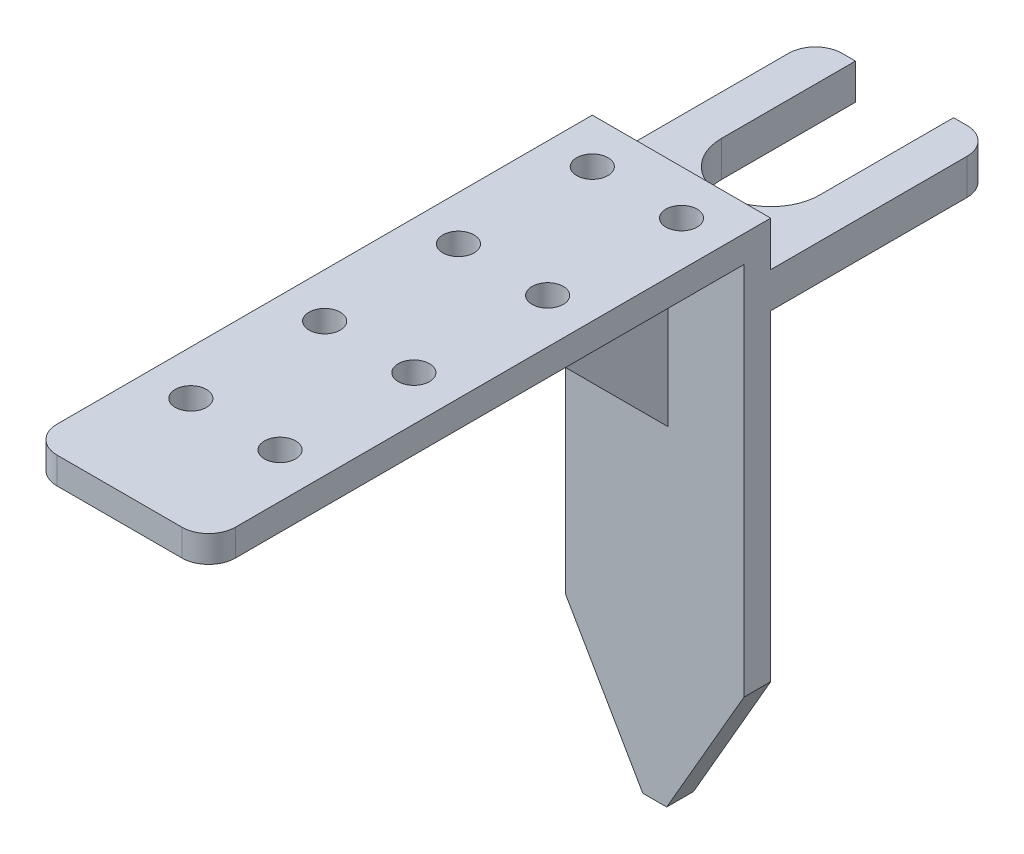
ISO-10303-21;
HEADER;
FILE_DESCRIPTION(('STEP AP214'),'2;1');
FILE_NAME('part.step','',(''),(''),'','','');
FILE_SCHEMA(('AUTOMOTIVE_DESIGN { 1 0 10303 214 1 1 1 1 }'));
ENDSEC;
DATA;
#1=APPLICATION_CONTEXT('core data for automotive mechanical design processes');
#2=APPLICATION_PROTOCOL_DEFINITION('international standard','automotive_design',2000,#1);
#3=PRODUCT_CONTEXT('',#1,'mechanical');
#4=PRODUCT('Part','Part','',(#3));
#5=PRODUCT_RELATED_PRODUCT_CATEGORY('part','',(#4));
#6=PRODUCT_DEFINITION_FORMATION('','',#4);
#7=PRODUCT_DEFINITION_CONTEXT('part definition',#1,'design');
#8=PRODUCT_DEFINITION('design','',#6,#7);
#9=PRODUCT_DEFINITION_SHAPE('','',#8);
#10=(LENGTH_UNIT() NAMED_UNIT(*) SI_UNIT(.MILLI.,.METRE.));
#11=(NAMED_UNIT(*) PLANE_ANGLE_UNIT() SI_UNIT($,.RADIAN.));
#12=(NAMED_UNIT(*) SI_UNIT($,.STERADIAN.) SOLID_ANGLE_UNIT());
#13=UNCERTAINTY_MEASURE_WITH_UNIT(LENGTH_MEASURE(1.E-05),#10,'distance_accuracy_value','');
#14=(GEOMETRIC_REPRESENTATION_CONTEXT(3) GLOBAL_UNCERTAINTY_ASSIGNED_CONTEXT((#13)) GLOBAL_UNIT_ASSIGNED_CONTEXT((#10,
#11,#12)) REPRESENTATION_CONTEXT('',''));
#15=CARTESIAN_POINT('',(0.,0.,0.));
#16=DIRECTION('',(0.,0.,1.));
#17=DIRECTION('',(1.,0.,0.));
#18=AXIS2_PLACEMENT_3D('',#15,#16,#17);
#19=CARTESIAN_POINT('',(0.,0.,-25.));
#20=DIRECTION('',(0.,0.,-1.));
#21=DIRECTION('',(-1.,0.,0.));
#22=AXIS2_PLACEMENT_3D('',#19,#20,#21);
#23=PLANE('',#22);
#24=DIRECTION('',(-1.,0.,0.));
#25=VECTOR('',#24,1.);
#26=CARTESIAN_POINT('',(10.,21.,-25.));
#27=LINE('',#26,#25);
#28=CARTESIAN_POINT('',(-5.5,21.,-25.));
#29=VERTEX_POINT('',#28);
#30=CARTESIAN_POINT('',(-7.,21.,-25.));
#31=VERTEX_POINT('',#30);
#32=EDGE_CURVE('E256',#29,#31,#27,.T.);
#33=ORIENTED_EDGE('',*,*,#32,.T.);
#34=DIRECTION('',(0.,1.,0.));
#35=VECTOR('',#34,1.);
#36=CARTESIAN_POINT('',(-7.,25.,-25.));
#37=LINE('',#36,#35);
#38=CARTESIAN_POINT('',(-7.,25.,-25.));
#39=VERTEX_POINT('',#38);
#40=EDGE_CURVE('E497',#31,#39,#37,.T.);
#41=ORIENTED_EDGE('',*,*,#40,.T.);
#42=DIRECTION('',(1.,0.,0.));
#43=VECTOR('',#42,1.);
#44=CARTESIAN_POINT('',(10.,25.,-25.));
#45=LINE('',#44,#43);
#46=CARTESIAN_POINT('',(-5.5,25.,-25.));
#47=VERTEX_POINT('',#46);
#48=EDGE_CURVE('E257',#39,#47,#45,.T.);
#49=ORIENTED_EDGE('',*,*,#48,.T.);
#50=DIRECTION('',(0.,1.,0.));
#51=VECTOR('',#50,1.);
#52=CARTESIAN_POINT('',(-5.5,0.,-25.));
#53=LINE('',#52,#51);
#54=EDGE_CURVE('E493',#29,#47,#53,.T.);
#55=ORIENTED_EDGE('',*,*,#54,.F.);
#56=EDGE_LOOP('',(#33,#41,#49,#55));
#57=FACE_BOUND('',#56,.T.);
#58=ADVANCED_FACE('F47',(#57),#23,.T.);
#59=CARTESIAN_POINT('',(0.,0.,0.));
#60=DIRECTION('',(0.,0.,1.));
#61=DIRECTION('',(1.,0.,0.));
#62=AXIS2_PLACEMENT_3D('',#59,#60,#61);
#63=PLANE('',#62);
#64=DIRECTION('',(1.,0.,0.));
#65=VECTOR('',#64,1.);
#66=CARTESIAN_POINT('',(10.,25.,0.));
#67=LINE('',#66,#65);
#68=CARTESIAN_POINT('',(-10.,25.,0.));
#69=VERTEX_POINT('',#68);
#70=CARTESIAN_POINT('',(9.99999999999999,25.,0.));
#71=VERTEX_POINT('',#70);
#72=EDGE_CURVE('E264',#69,#71,#67,.T.);
#73=ORIENTED_EDGE('',*,*,#72,.F.);
#74=DIRECTION('',(0.,-1.,0.));
#75=VECTOR('',#74,1.);
#76=CARTESIAN_POINT('',(-10.,30.,0.));
#77=LINE('',#76,#75);
#78=CARTESIAN_POINT('',(-10.,30.,0.));
#79=VERTEX_POINT('',#78);
#80=EDGE_CURVE('E383',#79,#69,#77,.T.);
#81=ORIENTED_EDGE('',*,*,#80,.F.);
#82=DIRECTION('',(-1.,0.,0.));
#83=VECTOR('',#82,1.);
#84=CARTESIAN_POINT('',(-10.,30.,0.));
#85=LINE('',#84,#83);
#86=CARTESIAN_POINT('',(9.99999999999999,30.,0.));
#87=VERTEX_POINT('',#86);
#88=EDGE_CURVE('E378',#87,#79,#85,.T.);
#89=ORIENTED_EDGE('',*,*,#88,.F.);
#90=DIRECTION('',(0.,1.,0.));
#91=VECTOR('',#90,1.);
#92=CARTESIAN_POINT('',(9.99999999999999,30.,0.));
#93=LINE('',#92,#91);
#94=EDGE_CURVE('E359',#71,#87,#93,.T.);
#95=ORIENTED_EDGE('',*,*,#94,.F.);
#96=EDGE_LOOP('',(#73,#81,#89,#95));
#97=FACE_BOUND('',#96,.T.);
#98=ADVANCED_FACE('F603',(#97),#63,.F.);
#99=DIRECTION('',(-1.,0.,0.));
#100=VECTOR('',#99,1.);
#101=CARTESIAN_POINT('',(10.,21.,0.));
#102=LINE('',#101,#100);
#103=CARTESIAN_POINT('',(10.,21.,0.));
#104=VERTEX_POINT('',#103);
#105=CARTESIAN_POINT('',(-10.,21.,0.));
#106=VERTEX_POINT('',#105);
#107=EDGE_CURVE('E252',#104,#106,#102,.T.);
#108=ORIENTED_EDGE('',*,*,#107,.F.);
#109=CARTESIAN_POINT('',(10.,-14.9999999999999,0.));
#110=VERTEX_POINT('',#109);
#111=EDGE_CURVE('E374',#110,#104,#93,.T.);
#112=ORIENTED_EDGE('',*,*,#111,.F.);
#113=DIRECTION('',(0.499999999999998,0.86602540378444,0.));
#114=VECTOR('',#113,1.);
#115=CARTESIAN_POINT('',(10.,-14.9999999999999,0.));
#116=LINE('',#115,#114);
#117=CARTESIAN_POINT('',(1.3397459621556,-30.,0.));
#118=VERTEX_POINT('',#117);
#119=EDGE_CURVE('E444',#110,#118,#116,.F.);
#120=ORIENTED_EDGE('',*,*,#119,.T.);
#121=DIRECTION('',(1.,0.,0.));
#122=VECTOR('',#121,1.);
#123=CARTESIAN_POINT('',(-10.,-30.,0.));
#124=LINE('',#123,#122);
#125=CARTESIAN_POINT('',(-1.3397459621556,-30.,0.));
#126=VERTEX_POINT('',#125);
#127=EDGE_CURVE('E365',#126,#118,#124,.T.);
#128=ORIENTED_EDGE('',*,*,#127,.F.);
#129=DIRECTION('',(0.499999999999998,-0.86602540378444,0.));
#130=VECTOR('',#129,1.);
#131=CARTESIAN_POINT('',(-1.3397459621556,-30.,0.));
#132=LINE('',#131,#130);
#133=CARTESIAN_POINT('',(-10.,-14.9999999999999,0.));
#134=VERTEX_POINT('',#133);
#135=EDGE_CURVE('E447',#126,#134,#132,.F.);
#136=ORIENTED_EDGE('',*,*,#135,.T.);
#137=EDGE_CURVE('E382',#106,#134,#77,.T.);
#138=ORIENTED_EDGE('',*,*,#137,.F.);
#139=EDGE_LOOP('',(#108,#112,#120,#128,#136,#138));
#140=FACE_BOUND('',#139,.T.);
#141=ADVANCED_FACE('F538',(#140),#63,.F.);
#142=CARTESIAN_POINT('',(5.,30.,50.));
#143=DIRECTION('',(0.,-1.,0.));
#144=DIRECTION('',(0.,0.,-1.));
#145=AXIS2_PLACEMENT_3D('',#142,#143,#144);
#146=CYLINDRICAL_SURFACE('',#145,1.75);
#147=CARTESIAN_POINT('',(5.,30.,50.));
#148=DIRECTION('',(0.,-1.,0.));
#149=DIRECTION('',(0.,0.,-1.));
#150=AXIS2_PLACEMENT_3D('',#147,#148,#149);
#151=CIRCLE('',#150,1.75);
#152=CARTESIAN_POINT('',(5.,30.,48.25));
#153=VERTEX_POINT('',#152);
#154=EDGE_CURVE('E429',#153,#153,#151,.T.);
#155=ORIENTED_EDGE('',*,*,#154,.F.);
#156=EDGE_LOOP('',(#155));
#157=FACE_BOUND('',#156,.T.);
#158=CARTESIAN_POINT('',(5.,27.,50.));
#159=DIRECTION('',(0.,-1.,0.));
#160=DIRECTION('',(0.,0.,-1.));
#161=AXIS2_PLACEMENT_3D('',#158,#159,#160);
#162=CIRCLE('',#161,1.75);
#163=CARTESIAN_POINT('',(5.,27.,48.25));
#164=VERTEX_POINT('',#163);
#165=EDGE_CURVE('E433',#164,#164,#162,.T.);
#166=ORIENTED_EDGE('',*,*,#165,.T.);
#167=EDGE_LOOP('',(#166));
#168=FACE_BOUND('',#167,.T.);
#169=ADVANCED_FACE('F694',(#157,#168),#146,.F.);
#170=CARTESIAN_POINT('',(5.,30.,35.));
#171=DIRECTION('',(0.,-1.,0.));
#172=DIRECTION('',(0.,0.,-1.));
#173=AXIS2_PLACEMENT_3D('',#170,#171,#172);
#174=CYLINDRICAL_SURFACE('',#173,1.75);
#175=CARTESIAN_POINT('',(5.,30.,35.));
#176=DIRECTION('',(0.,-1.,0.));
#177=DIRECTION('',(0.,0.,-1.));
#178=AXIS2_PLACEMENT_3D('',#175,#176,#177);
#179=CIRCLE('',#178,1.75);
#180=CARTESIAN_POINT('',(5.,30.,33.25));
#181=VERTEX_POINT('',#180);
#182=EDGE_CURVE('E421',#181,#181,#179,.T.);
#183=ORIENTED_EDGE('',*,*,#182,.F.);
#184=EDGE_LOOP('',(#183));
#185=FACE_BOUND('',#184,.T.);
#186=CARTESIAN_POINT('',(5.,27.,35.));
#187=DIRECTION('',(0.,-1.,0.));
#188=DIRECTION('',(0.,0.,-1.));
#189=AXIS2_PLACEMENT_3D('',#186,#187,#188);
#190=CIRCLE('',#189,1.75);
#191=CARTESIAN_POINT('',(5.,27.,33.25));
#192=VERTEX_POINT('',#191);
#193=EDGE_CURVE('E425',#192,#192,#190,.T.);
#194=ORIENTED_EDGE('',*,*,#193,.T.);
#195=EDGE_LOOP('',(#194));
#196=FACE_BOUND('',#195,.T.);
#197=ADVANCED_FACE('F690',(#185,#196),#174,.F.);
#198=CARTESIAN_POINT('',(-5.,30.,50.));
#199=DIRECTION('',(0.,-1.,0.));
#200=DIRECTION('',(0.,0.,-1.));
#201=AXIS2_PLACEMENT_3D('',#198,#199,#200);
#202=CYLINDRICAL_SURFACE('',#201,1.75);
#203=CARTESIAN_POINT('',(-5.,30.,50.));
#204=DIRECTION('',(0.,-1.,0.));
#205=DIRECTION('',(0.,0.,-1.));
#206=AXIS2_PLACEMENT_3D('',#203,#204,#205);
#207=CIRCLE('',#206,1.75);
#208=CARTESIAN_POINT('',(-5.,30.,48.25));
#209=VERTEX_POINT('',#208);
#210=EDGE_CURVE('E413',#209,#209,#207,.T.);
#211=ORIENTED_EDGE('',*,*,#210,.F.);
#212=EDGE_LOOP('',(#211));
#213=FACE_BOUND('',#212,.T.);
#214=CARTESIAN_POINT('',(-5.,27.,50.));
#215=DIRECTION('',(0.,-1.,0.));
#216=DIRECTION('',(0.,0.,-1.));
#217=AXIS2_PLACEMENT_3D('',#214,#215,#216);
#218=CIRCLE('',#217,1.75);
#219=CARTESIAN_POINT('',(-5.,27.,48.25));
#220=VERTEX_POINT('',#219);
#221=EDGE_CURVE('E417',#220,#220,#218,.T.);
#222=ORIENTED_EDGE('',*,*,#221,.T.);
#223=EDGE_LOOP('',(#222));
#224=FACE_BOUND('',#223,.T.);
#225=ADVANCED_FACE('F686',(#213,#224),#202,.F.);
#226=CARTESIAN_POINT('',(-5.,30.,35.));
#227=DIRECTION('',(0.,-1.,0.));
#228=DIRECTION('',(0.,0.,-1.));
#229=AXIS2_PLACEMENT_3D('',#226,#227,#228);
#230=CYLINDRICAL_SURFACE('',#229,1.75);
#231=CARTESIAN_POINT('',(-5.,30.,35.));
#232=DIRECTION('',(0.,-1.,0.));
#233=DIRECTION('',(0.,0.,-1.));
#234=AXIS2_PLACEMENT_3D('',#231,#232,#233);
#235=CIRCLE('',#234,1.75);
#236=CARTESIAN_POINT('',(-5.,30.,33.25));
#237=VERTEX_POINT('',#236);
#238=EDGE_CURVE('E405',#237,#237,#235,.T.);
#239=ORIENTED_EDGE('',*,*,#238,.F.);
#240=EDGE_LOOP('',(#239));
#241=FACE_BOUND('',#240,.T.);
#242=CARTESIAN_POINT('',(-5.,27.,35.));
#243=DIRECTION('',(0.,-1.,0.));
#244=DIRECTION('',(0.,0.,-1.));
#245=AXIS2_PLACEMENT_3D('',#242,#243,#244);
#246=CIRCLE('',#245,1.75);
#247=CARTESIAN_POINT('',(-5.,27.,33.25));
#248=VERTEX_POINT('',#247);
#249=EDGE_CURVE('E409',#248,#248,#246,.T.);
#250=ORIENTED_EDGE('',*,*,#249,.T.);
#251=EDGE_LOOP('',(#250));
#252=FACE_BOUND('',#251,.T.);
#253=ADVANCED_FACE('F667',(#241,#252),#230,.F.);
#254=CARTESIAN_POINT('',(0.,0.,3.));
#255=DIRECTION('',(0.,0.,1.));
#256=DIRECTION('',(1.,0.,0.));
#257=AXIS2_PLACEMENT_3D('',#254,#255,#256);
#258=PLANE('',#257);
#259=DIRECTION('',(0.,-1.,0.));
#260=VECTOR('',#259,1.);
#261=CARTESIAN_POINT('',(-10.,30.,3.));
#262=LINE('',#261,#260);
#263=CARTESIAN_POINT('',(-10.,27.,3.));
#264=VERTEX_POINT('',#263);
#265=CARTESIAN_POINT('',(-10.,-14.9999999999999,3.));
#266=VERTEX_POINT('',#265);
#267=EDGE_CURVE('E364',#264,#266,#262,.T.);
#268=ORIENTED_EDGE('',*,*,#267,.T.);
#269=DIRECTION('',(-0.499999999999998,0.86602540378444,0.));
#270=VECTOR('',#269,1.);
#271=CARTESIAN_POINT('',(-13.9951905283832,-8.08012701892213,3.));
#272=LINE('',#271,#270);
#273=CARTESIAN_POINT('',(-1.3397459621556,-30.,3.));
#274=VERTEX_POINT('',#273);
#275=EDGE_CURVE('E457',#266,#274,#272,.F.);
#276=ORIENTED_EDGE('',*,*,#275,.T.);
#277=DIRECTION('',(1.,0.,0.));
#278=VECTOR('',#277,1.);
#279=CARTESIAN_POINT('',(-10.,-30.,3.));
#280=LINE('',#279,#278);
#281=CARTESIAN_POINT('',(1.3397459621556,-30.,3.));
#282=VERTEX_POINT('',#281);
#283=EDGE_CURVE('E369',#274,#282,#280,.T.);
#284=ORIENTED_EDGE('',*,*,#283,.T.);
#285=DIRECTION('',(-0.499999999999998,-0.86602540378444,0.));
#286=VECTOR('',#285,1.);
#287=CARTESIAN_POINT('',(13.9951905283832,-8.08012701892212,3.));
#288=LINE('',#287,#286);
#289=CARTESIAN_POINT('',(10.,-14.9999999999999,3.));
#290=VERTEX_POINT('',#289);
#291=EDGE_CURVE('E454',#282,#290,#288,.F.);
#292=ORIENTED_EDGE('',*,*,#291,.T.);
#293=DIRECTION('',(0.,1.,0.));
#294=VECTOR('',#293,1.);
#295=CARTESIAN_POINT('',(9.99999999999999,30.,3.));
#296=LINE('',#295,#294);
#297=CARTESIAN_POINT('',(10.,27.,3.));
#298=VERTEX_POINT('',#297);
#299=EDGE_CURVE('E360',#290,#298,#296,.T.);
#300=ORIENTED_EDGE('',*,*,#299,.T.);
#301=DIRECTION('',(1.,0.,0.));
#302=VECTOR('',#301,1.);
#303=CARTESIAN_POINT('',(-10.,27.,3.));
#304=LINE('',#303,#302);
#305=CARTESIAN_POINT('',(1.5,27.,3.));
#306=VERTEX_POINT('',#305);
#307=EDGE_CURVE('E340',#306,#298,#304,.T.);
#308=ORIENTED_EDGE('',*,*,#307,.F.);
#309=DIRECTION('',(0.,1.,0.));
#310=VECTOR('',#309,1.);
#311=CARTESIAN_POINT('',(1.5,7.00000000000001,3.));
#312=LINE('',#311,#310);
#313=CARTESIAN_POINT('',(1.5,7.00000000000001,3.));
#314=VERTEX_POINT('',#313);
#315=EDGE_CURVE('E333',#314,#306,#312,.T.);
#316=ORIENTED_EDGE('',*,*,#315,.F.);
#317=DIRECTION('',(1.,0.,0.));
#318=VECTOR('',#317,1.);
#319=CARTESIAN_POINT('',(-1.5,7.00000000000001,3.));
#320=LINE('',#319,#318);
#321=CARTESIAN_POINT('',(-1.5,7.00000000000001,3.));
#322=VERTEX_POINT('',#321);
#323=EDGE_CURVE('E312',#322,#314,#320,.T.);
#324=ORIENTED_EDGE('',*,*,#323,.F.);
#325=DIRECTION('',(0.,1.,0.));
#326=VECTOR('',#325,1.);
#327=CARTESIAN_POINT('',(-1.5,7.00000000000001,3.));
#328=LINE('',#327,#326);
#329=CARTESIAN_POINT('',(-1.5,27.,3.));
#330=VERTEX_POINT('',#329);
#331=EDGE_CURVE('E337',#322,#330,#328,.T.);
#332=ORIENTED_EDGE('',*,*,#331,.T.);
#333=EDGE_CURVE('E346',#264,#330,#304,.T.);
#334=ORIENTED_EDGE('',*,*,#333,.F.);
#335=EDGE_LOOP('',(#268,#276,#284,#292,#300,#308,#316,#324,#332,#334));
#336=FACE_BOUND('',#335,.T.);
#337=ADVANCED_FACE('F560',(#336),#258,.T.);
#338=CARTESIAN_POINT('',(-10.,27.,63.));
#339=DIRECTION('',(0.,1.,0.));
#340=DIRECTION('',(0.,0.,1.));
#341=AXIS2_PLACEMENT_3D('',#338,#339,#340);
#342=PLANE('',#341);
#343=CARTESIAN_POINT('',(5.,27.,20.));
#344=DIRECTION('',(0.,-1.,0.));
#345=DIRECTION('',(0.,0.,-1.));
#346=AXIS2_PLACEMENT_3D('',#343,#344,#345);
#347=CIRCLE('',#346,1.75);
#348=CARTESIAN_POINT('',(5.,27.,18.25));
#349=VERTEX_POINT('',#348);
#350=EDGE_CURVE('E283',#349,#349,#347,.T.);
#351=ORIENTED_EDGE('',*,*,#350,.F.);
#352=EDGE_LOOP('',(#351));
#353=FACE_BOUND('',#352,.T.);
#354=CARTESIAN_POINT('',(-5.,27.,20.));
#355=DIRECTION('',(0.,-1.,0.));
#356=DIRECTION('',(0.,0.,-1.));
#357=AXIS2_PLACEMENT_3D('',#354,#355,#356);
#358=CIRCLE('',#357,1.75);
#359=CARTESIAN_POINT('',(-5.,27.,18.25));
#360=VERTEX_POINT('',#359);
#361=EDGE_CURVE('E291',#360,#360,#358,.T.);
#362=ORIENTED_EDGE('',*,*,#361,.F.);
#363=EDGE_LOOP('',(#362));
#364=FACE_BOUND('',#363,.T.);
#365=CARTESIAN_POINT('',(-5.,27.,5.));
#366=DIRECTION('',(0.,-1.,0.));
#367=DIRECTION('',(0.,0.,-1.));
#368=AXIS2_PLACEMENT_3D('',#365,#366,#367);
#369=CIRCLE('',#368,1.75);
#370=CARTESIAN_POINT('',(-5.,27.,3.25));
#371=VERTEX_POINT('',#370);
#372=EDGE_CURVE('E301',#371,#371,#369,.T.);
#373=ORIENTED_EDGE('',*,*,#372,.F.);
#374=EDGE_LOOP('',(#373));
#375=FACE_BOUND('',#374,.T.);
#376=CARTESIAN_POINT('',(5.,27.,5.));
#377=DIRECTION('',(0.,-1.,0.));
#378=DIRECTION('',(0.,0.,-1.));
#379=AXIS2_PLACEMENT_3D('',#376,#377,#378);
#380=CIRCLE('',#379,1.75);
#381=CARTESIAN_POINT('',(5.,27.,3.25));
#382=VERTEX_POINT('',#381);
#383=EDGE_CURVE('E305',#382,#382,#380,.T.);
#384=ORIENTED_EDGE('',*,*,#383,.F.);
#385=EDGE_LOOP('',(#384));
#386=FACE_BOUND('',#385,.T.);
#387=DIRECTION('',(1.,0.,0.));
#388=VECTOR('',#387,1.);
#389=CARTESIAN_POINT('',(-10.,27.,63.));
#390=LINE('',#389,#388);
#391=CARTESIAN_POINT('',(-7.00000000000001,27.,63.));
#392=VERTEX_POINT('',#391);
#393=CARTESIAN_POINT('',(6.99999999999999,27.,63.));
#394=VERTEX_POINT('',#393);
#395=EDGE_CURVE('E341',#392,#394,#390,.T.);
#396=ORIENTED_EDGE('',*,*,#395,.F.);
#397=CARTESIAN_POINT('',(-7.00000000000001,27.,60.));
#398=DIRECTION('',(0.,1.,0.));
#399=DIRECTION('',(0.,0.,1.));
#400=AXIS2_PLACEMENT_3D('',#397,#398,#399);
#401=CIRCLE('',#400,3.);
#402=CARTESIAN_POINT('',(-10.,27.,60.));
#403=VERTEX_POINT('',#402);
#404=EDGE_CURVE('E475',#392,#403,#401,.F.);
#405=ORIENTED_EDGE('',*,*,#404,.T.);
#406=DIRECTION('',(0.,0.,-1.));
#407=VECTOR('',#406,1.);
#408=CARTESIAN_POINT('',(-10.,27.,63.));
#409=LINE('',#408,#407);
#410=EDGE_CURVE('E356',#403,#264,#409,.T.);
#411=ORIENTED_EDGE('',*,*,#410,.T.);
#412=ORIENTED_EDGE('',*,*,#333,.T.);
#413=DIRECTION('',(0.,0.,-1.));
#414=VECTOR('',#413,1.);
#415=CARTESIAN_POINT('',(-1.5,27.,3.));
#416=LINE('',#415,#414);
#417=CARTESIAN_POINT('',(-1.5,27.,18.));
#418=VERTEX_POINT('',#417);
#419=EDGE_CURVE('E300',#418,#330,#416,.T.);
#420=ORIENTED_EDGE('',*,*,#419,.F.);
#421=DIRECTION('',(-1.,0.,0.));
#422=VECTOR('',#421,1.);
#423=CARTESIAN_POINT('',(-1.5,27.,18.));
#424=LINE('',#423,#422);
#425=CARTESIAN_POINT('',(1.5,27.,18.));
#426=VERTEX_POINT('',#425);
#427=EDGE_CURVE('E317',#426,#418,#424,.T.);
#428=ORIENTED_EDGE('',*,*,#427,.F.);
#429=DIRECTION('',(0.,0.,1.));
#430=VECTOR('',#429,1.);
#431=CARTESIAN_POINT('',(1.5,27.,3.));
#432=LINE('',#431,#430);
#433=EDGE_CURVE('E321',#306,#426,#432,.T.);
#434=ORIENTED_EDGE('',*,*,#433,.F.);
#435=ORIENTED_EDGE('',*,*,#307,.T.);
#436=DIRECTION('',(0.,0.,-1.));
#437=VECTOR('',#436,1.);
#438=CARTESIAN_POINT('',(10.,27.,63.));
#439=LINE('',#438,#437);
#440=CARTESIAN_POINT('',(10.,27.,60.));
#441=VERTEX_POINT('',#440);
#442=EDGE_CURVE('E350',#441,#298,#439,.T.);
#443=ORIENTED_EDGE('',*,*,#442,.F.);
#444=CARTESIAN_POINT('',(6.99999999999999,27.,60.));
#445=DIRECTION('',(0.,1.,0.));
#446=DIRECTION('',(0.,0.,1.));
#447=AXIS2_PLACEMENT_3D('',#444,#445,#446);
#448=CIRCLE('',#447,3.);
#449=EDGE_CURVE('E472',#441,#394,#448,.F.);
#450=ORIENTED_EDGE('',*,*,#449,.T.);
#451=EDGE_LOOP('',(#396,#405,#411,#412,#420,#428,#434,#435,#443,#450));
#452=FACE_BOUND('',#451,.T.);
#453=ORIENTED_EDGE('',*,*,#249,.F.);
#454=EDGE_LOOP('',(#453));
#455=FACE_BOUND('',#454,.T.);
#456=ORIENTED_EDGE('',*,*,#221,.F.);
#457=EDGE_LOOP('',(#456));
#458=FACE_BOUND('',#457,.T.);
#459=ORIENTED_EDGE('',*,*,#193,.F.);
#460=EDGE_LOOP('',(#459));
#461=FACE_BOUND('',#460,.T.);
#462=ORIENTED_EDGE('',*,*,#165,.F.);
#463=EDGE_LOOP('',(#462));
#464=FACE_BOUND('',#463,.T.);
#465=ADVANCED_FACE('F566',(#353,#364,#375,#386,#452,#455,#458,#461,#464),#342,.F.);
#466=CARTESIAN_POINT('',(9.99999999999999,30.,3.));
#467=DIRECTION('',(-1.,0.,0.));
#468=DIRECTION('',(0.,-1.,0.));
#469=AXIS2_PLACEMENT_3D('',#466,#467,#468);
#470=PLANE('',#469);
#471=DIRECTION('',(0.,0.,1.));
#472=VECTOR('',#471,1.);
#473=CARTESIAN_POINT('',(10.,21.,-25.));
#474=LINE('',#473,#472);
#475=CARTESIAN_POINT('',(10.,21.,-22.));
#476=VERTEX_POINT('',#475);
#477=EDGE_CURVE('E276',#476,#104,#474,.T.);
#478=ORIENTED_EDGE('',*,*,#477,.F.);
#479=DIRECTION('',(0.,-1.,0.));
#480=VECTOR('',#479,1.);
#481=CARTESIAN_POINT('',(9.99999999999999,25.,-22.));
#482=LINE('',#481,#480);
#483=CARTESIAN_POINT('',(10.,25.,-22.));
#484=VERTEX_POINT('',#483);
#485=EDGE_CURVE('E11',#476,#484,#482,.F.);
#486=ORIENTED_EDGE('',*,*,#485,.T.);
#487=DIRECTION('',(0.,0.,1.));
#488=VECTOR('',#487,1.);
#489=CARTESIAN_POINT('',(10.,25.,-25.));
#490=LINE('',#489,#488);
#491=EDGE_CURVE('E260',#484,#71,#490,.T.);
#492=ORIENTED_EDGE('',*,*,#491,.T.);
#493=ORIENTED_EDGE('',*,*,#94,.T.);
#494=DIRECTION('',(0.,0.,-1.));
#495=VECTOR('',#494,1.);
#496=CARTESIAN_POINT('',(9.99999999999999,30.,3.));
#497=LINE('',#496,#495);
#498=CARTESIAN_POINT('',(9.99999999999999,30.,60.));
#499=VERTEX_POINT('',#498);
#500=EDGE_CURVE('E392',#499,#87,#497,.T.);
#501=ORIENTED_EDGE('',*,*,#500,.F.);
#502=DIRECTION('',(0.,1.,0.));
#503=VECTOR('',#502,1.);
#504=CARTESIAN_POINT('',(9.99999999999999,27.,60.));
#505=LINE('',#504,#503);
#506=EDGE_CURVE('E487',#499,#441,#505,.F.);
#507=ORIENTED_EDGE('',*,*,#506,.T.);
#508=ORIENTED_EDGE('',*,*,#442,.T.);
#509=ORIENTED_EDGE('',*,*,#299,.F.);
#510=DIRECTION('',(0.,0.,-1.));
#511=VECTOR('',#510,1.);
#512=CARTESIAN_POINT('',(10.,-14.9999999999999,3.));
#513=LINE('',#512,#511);
#514=EDGE_CURVE('E460',#290,#110,#513,.T.);
#515=ORIENTED_EDGE('',*,*,#514,.T.);
#516=ORIENTED_EDGE('',*,*,#111,.T.);
#517=EDGE_LOOP('',(#478,#486,#492,#493,#501,#507,#508,#509,#515,#516));
#518=FACE_BOUND('',#517,.T.);
#519=ADVANCED_FACE('F540',(#518),#470,.F.);
#520=CARTESIAN_POINT('',(-10.,30.,3.));
#521=DIRECTION('',(0.,-1.,0.));
#522=DIRECTION('',(0.,0.,-1.));
#523=AXIS2_PLACEMENT_3D('',#520,#521,#522);
#524=PLANE('',#523);
#525=CARTESIAN_POINT('',(5.,30.,20.));
#526=DIRECTION('',(0.,-1.,0.));
#527=DIRECTION('',(0.,0.,-1.));
#528=AXIS2_PLACEMENT_3D('',#525,#526,#527);
#529=CIRCLE('',#528,1.75);
#530=CARTESIAN_POINT('',(5.,30.,18.25));
#531=VERTEX_POINT('',#530);
#532=EDGE_CURVE('E279',#531,#531,#529,.T.);
#533=ORIENTED_EDGE('',*,*,#532,.T.);
#534=EDGE_LOOP('',(#533));
#535=FACE_BOUND('',#534,.T.);
#536=CARTESIAN_POINT('',(-5.,30.,20.));
#537=DIRECTION('',(0.,-1.,0.));
#538=DIRECTION('',(0.,0.,-1.));
#539=AXIS2_PLACEMENT_3D('',#536,#537,#538);
#540=CIRCLE('',#539,1.75);
#541=CARTESIAN_POINT('',(-5.,30.,18.25));
#542=VERTEX_POINT('',#541);
#543=EDGE_CURVE('E287',#542,#542,#540,.T.);
#544=ORIENTED_EDGE('',*,*,#543,.T.);
#545=EDGE_LOOP('',(#544));
#546=FACE_BOUND('',#545,.T.);
#547=CARTESIAN_POINT('',(-5.,30.,5.));
#548=DIRECTION('',(0.,-1.,0.));
#549=DIRECTION('',(0.,0.,-1.));
#550=AXIS2_PLACEMENT_3D('',#547,#548,#549);
#551=CIRCLE('',#550,1.75);
#552=CARTESIAN_POINT('',(-5.,30.,3.25));
#553=VERTEX_POINT('',#552);
#554=EDGE_CURVE('E296',#553,#553,#551,.T.);
#555=ORIENTED_EDGE('',*,*,#554,.T.);
#556=EDGE_LOOP('',(#555));
#557=FACE_BOUND('',#556,.T.);
#558=CARTESIAN_POINT('',(5.,30.,5.));
#559=DIRECTION('',(0.,-1.,0.));
#560=DIRECTION('',(0.,0.,-1.));
#561=AXIS2_PLACEMENT_3D('',#558,#559,#560);
#562=CIRCLE('',#561,1.75);
#563=CARTESIAN_POINT('',(5.,30.,3.25));
#564=VERTEX_POINT('',#563);
#565=EDGE_CURVE('E295',#564,#564,#562,.T.);
#566=ORIENTED_EDGE('',*,*,#565,.T.);
#567=EDGE_LOOP('',(#566));
#568=FACE_BOUND('',#567,.T.);
#569=DIRECTION('',(0.,0.,-1.));
#570=VECTOR('',#569,1.);
#571=CARTESIAN_POINT('',(-10.,30.,3.));
#572=LINE('',#571,#570);
#573=CARTESIAN_POINT('',(-10.,30.,60.));
#574=VERTEX_POINT('',#573);
#575=EDGE_CURVE('E373',#574,#79,#572,.T.);
#576=ORIENTED_EDGE('',*,*,#575,.F.);
#577=CARTESIAN_POINT('',(-7.00000000000001,30.,60.));
#578=DIRECTION('',(0.,-1.,0.));
#579=DIRECTION('',(0.,0.,-1.));
#580=AXIS2_PLACEMENT_3D('',#577,#578,#579);
#581=CIRCLE('',#580,3.);
#582=CARTESIAN_POINT('',(-7.00000000000001,30.,63.));
#583=VERTEX_POINT('',#582);
#584=EDGE_CURVE('E484',#574,#583,#581,.F.);
#585=ORIENTED_EDGE('',*,*,#584,.T.);
#586=DIRECTION('',(-1.,0.,0.));
#587=VECTOR('',#586,1.);
#588=CARTESIAN_POINT('',(-10.,30.,63.));
#589=LINE('',#588,#587);
#590=CARTESIAN_POINT('',(6.99999999999999,30.,63.));
#591=VERTEX_POINT('',#590);
#592=EDGE_CURVE('E345',#591,#583,#589,.T.);
#593=ORIENTED_EDGE('',*,*,#592,.F.);
#594=CARTESIAN_POINT('',(6.99999999999999,30.,60.));
#595=DIRECTION('',(0.,-1.,0.));
#596=DIRECTION('',(0.,0.,-1.));
#597=AXIS2_PLACEMENT_3D('',#594,#595,#596);
#598=CIRCLE('',#597,3.);
#599=EDGE_CURVE('E481',#591,#499,#598,.F.);
#600=ORIENTED_EDGE('',*,*,#599,.T.);
#601=ORIENTED_EDGE('',*,*,#500,.T.);
#602=ORIENTED_EDGE('',*,*,#88,.T.);
#603=EDGE_LOOP('',(#576,#585,#593,#600,#601,#602));
#604=FACE_BOUND('',#603,.T.);
#605=ORIENTED_EDGE('',*,*,#238,.T.);
#606=EDGE_LOOP('',(#605));
#607=FACE_BOUND('',#606,.T.);
#608=ORIENTED_EDGE('',*,*,#210,.T.);
#609=EDGE_LOOP('',(#608));
#610=FACE_BOUND('',#609,.T.);
#611=ORIENTED_EDGE('',*,*,#182,.T.);
#612=EDGE_LOOP('',(#611));
#613=FACE_BOUND('',#612,.T.);
#614=ORIENTED_EDGE('',*,*,#154,.T.);
#615=EDGE_LOOP('',(#614));
#616=FACE_BOUND('',#615,.T.);
#617=ADVANCED_FACE('F599',(#535,#546,#557,#568,#604,#607,#610,#613,#616),#524,.F.);
#618=CARTESIAN_POINT('',(-10.,30.,3.));
#619=DIRECTION('',(1.,0.,0.));
#620=DIRECTION('',(0.,1.,0.));
#621=AXIS2_PLACEMENT_3D('',#618,#619,#620);
#622=PLANE('',#621);
#623=DIRECTION('',(0.,0.,1.));
#624=VECTOR('',#623,1.);
#625=CARTESIAN_POINT('',(-10.,25.,-25.));
#626=LINE('',#625,#624);
#627=CARTESIAN_POINT('',(-10.,25.,-22.));
#628=VERTEX_POINT('',#627);
#629=EDGE_CURVE('E270',#628,#69,#626,.T.);
#630=ORIENTED_EDGE('',*,*,#629,.F.);
#631=DIRECTION('',(0.,1.,0.));
#632=VECTOR('',#631,1.);
#633=CARTESIAN_POINT('',(-10.,21.,-22.));
#634=LINE('',#633,#632);
#635=CARTESIAN_POINT('',(-10.,21.,-22.));
#636=VERTEX_POINT('',#635);
#637=EDGE_CURVE('E507',#628,#636,#634,.F.);
#638=ORIENTED_EDGE('',*,*,#637,.T.);
#639=DIRECTION('',(0.,0.,1.));
#640=VECTOR('',#639,1.);
#641=CARTESIAN_POINT('',(-10.,21.,-25.));
#642=LINE('',#641,#640);
#643=EDGE_CURVE('E273',#636,#106,#642,.T.);
#644=ORIENTED_EDGE('',*,*,#643,.T.);
#645=ORIENTED_EDGE('',*,*,#137,.T.);
#646=DIRECTION('',(0.,0.,1.));
#647=VECTOR('',#646,1.);
#648=CARTESIAN_POINT('',(-10.,-14.9999999999999,3.));
#649=LINE('',#648,#647);
#650=EDGE_CURVE('E451',#134,#266,#649,.T.);
#651=ORIENTED_EDGE('',*,*,#650,.T.);
#652=ORIENTED_EDGE('',*,*,#267,.F.);
#653=ORIENTED_EDGE('',*,*,#410,.F.);
#654=DIRECTION('',(0.,-1.,0.));
#655=VECTOR('',#654,1.);
#656=CARTESIAN_POINT('',(-10.,30.,60.));
#657=LINE('',#656,#655);
#658=EDGE_CURVE('E478',#403,#574,#657,.F.);
#659=ORIENTED_EDGE('',*,*,#658,.T.);
#660=ORIENTED_EDGE('',*,*,#575,.T.);
#661=ORIENTED_EDGE('',*,*,#80,.T.);
#662=EDGE_LOOP('',(#630,#638,#644,#645,#651,#652,#653,#659,#660,#661));
#663=FACE_BOUND('',#662,.T.);
#664=ADVANCED_FACE('F533',(#663),#622,.F.);
#665=CARTESIAN_POINT('',(-10.,-30.,3.));
#666=DIRECTION('',(0.,1.,0.));
#667=DIRECTION('',(0.,0.,1.));
#668=AXIS2_PLACEMENT_3D('',#665,#666,#667);
#669=PLANE('',#668);
#670=ORIENTED_EDGE('',*,*,#283,.F.);
#671=DIRECTION('',(0.,0.,-1.));
#672=VECTOR('',#671,1.);
#673=CARTESIAN_POINT('',(-1.3397459621556,-30.,3.));
#674=LINE('',#673,#672);
#675=EDGE_CURVE('E440',#274,#126,#674,.T.);
#676=ORIENTED_EDGE('',*,*,#675,.T.);
#677=ORIENTED_EDGE('',*,*,#127,.T.);
#678=DIRECTION('',(0.,0.,1.));
#679=VECTOR('',#678,1.);
#680=CARTESIAN_POINT('',(1.3397459621556,-30.,3.));
#681=LINE('',#680,#679);
#682=EDGE_CURVE('E437',#118,#282,#681,.T.);
#683=ORIENTED_EDGE('',*,*,#682,.T.);
#684=EDGE_LOOP('',(#670,#676,#677,#683));
#685=FACE_BOUND('',#684,.T.);
#686=ADVANCED_FACE('F550',(#685),#669,.F.);
#687=CARTESIAN_POINT('',(0.,0.,63.));
#688=DIRECTION('',(0.,0.,1.));
#689=DIRECTION('',(1.,0.,0.));
#690=AXIS2_PLACEMENT_3D('',#687,#688,#689);
#691=PLANE('',#690);
#692=ORIENTED_EDGE('',*,*,#592,.T.);
#693=DIRECTION('',(0.,-1.,0.));
#694=VECTOR('',#693,1.);
#695=CARTESIAN_POINT('',(-7.00000000000001,27.,63.));
#696=LINE('',#695,#694);
#697=EDGE_CURVE('E468',#583,#392,#696,.T.);
#698=ORIENTED_EDGE('',*,*,#697,.T.);
#699=ORIENTED_EDGE('',*,*,#395,.T.);
#700=DIRECTION('',(0.,1.,0.));
#701=VECTOR('',#700,1.);
#702=CARTESIAN_POINT('',(6.99999999999999,30.,63.));
#703=LINE('',#702,#701);
#704=EDGE_CURVE('E464',#394,#591,#703,.T.);
#705=ORIENTED_EDGE('',*,*,#704,.T.);
#706=EDGE_LOOP('',(#692,#698,#699,#705));
#707=FACE_BOUND('',#706,.T.);
#708=ADVANCED_FACE('F610',(#707),#691,.T.);
#709=CARTESIAN_POINT('',(-1.5,7.00000000000001,3.));
#710=DIRECTION('',(1.,0.,0.));
#711=DIRECTION('',(0.,0.,-1.));
#712=AXIS2_PLACEMENT_3D('',#709,#710,#711);
#713=PLANE('',#712);
#714=ORIENTED_EDGE('',*,*,#331,.F.);
#715=DIRECTION('',(0.,-0.707106781186549,-0.707106781186547));
#716=VECTOR('',#715,1.);
#717=CARTESIAN_POINT('',(-1.5,7.00000000000001,2.99999999999999));
#718=LINE('',#717,#716);
#719=CARTESIAN_POINT('',(-1.5,22.0000000000001,18.));
#720=VERTEX_POINT('',#719);
#721=EDGE_CURVE('E396',#322,#720,#718,.F.);
#722=ORIENTED_EDGE('',*,*,#721,.T.);
#723=DIRECTION('',(0.,1.,0.));
#724=VECTOR('',#723,1.);
#725=CARTESIAN_POINT('',(-1.5,7.00000000000001,18.));
#726=LINE('',#725,#724);
#727=EDGE_CURVE('E316',#720,#418,#726,.T.);
#728=ORIENTED_EDGE('',*,*,#727,.T.);
#729=ORIENTED_EDGE('',*,*,#419,.T.);
#730=EDGE_LOOP('',(#714,#722,#728,#729));
#731=FACE_BOUND('',#730,.T.);
#732=ADVANCED_FACE('F570',(#731),#713,.F.);
#733=CARTESIAN_POINT('',(1.5,7.00000000000001,3.));
#734=DIRECTION('',(-1.,0.,0.));
#735=DIRECTION('',(0.,0.,1.));
#736=AXIS2_PLACEMENT_3D('',#733,#734,#735);
#737=PLANE('',#736);
#738=DIRECTION('',(0.,1.,0.));
#739=VECTOR('',#738,1.);
#740=CARTESIAN_POINT('',(1.5,7.00000000000001,18.));
#741=LINE('',#740,#739);
#742=CARTESIAN_POINT('',(1.5,22.0000000000001,18.));
#743=VERTEX_POINT('',#742);
#744=EDGE_CURVE('E330',#743,#426,#741,.T.);
#745=ORIENTED_EDGE('',*,*,#744,.F.);
#746=DIRECTION('',(0.,0.707106781186549,0.707106781186547));
#747=VECTOR('',#746,1.);
#748=CARTESIAN_POINT('',(1.5,7.00000000000001,2.99999999999999));
#749=LINE('',#748,#747);
#750=EDGE_CURVE('E402',#743,#314,#749,.F.);
#751=ORIENTED_EDGE('',*,*,#750,.T.);
#752=ORIENTED_EDGE('',*,*,#315,.T.);
#753=ORIENTED_EDGE('',*,*,#433,.T.);
#754=EDGE_LOOP('',(#745,#751,#752,#753));
#755=FACE_BOUND('',#754,.T.);
#756=ADVANCED_FACE('F581',(#755),#737,.F.);
#757=CARTESIAN_POINT('',(-1.5,7.00000000000001,18.));
#758=DIRECTION('',(0.,0.,-1.));
#759=DIRECTION('',(-1.,0.,0.));
#760=AXIS2_PLACEMENT_3D('',#757,#758,#759);
#761=PLANE('',#760);
#762=ORIENTED_EDGE('',*,*,#727,.F.);
#763=DIRECTION('',(1.,0.,0.));
#764=VECTOR('',#763,1.);
#765=CARTESIAN_POINT('',(-1.5,22.0000000000001,18.));
#766=LINE('',#765,#764);
#767=EDGE_CURVE('E399',#720,#743,#766,.T.);
#768=ORIENTED_EDGE('',*,*,#767,.T.);
#769=ORIENTED_EDGE('',*,*,#744,.T.);
#770=ORIENTED_EDGE('',*,*,#427,.T.);
#771=EDGE_LOOP('',(#762,#768,#769,#770));
#772=FACE_BOUND('',#771,.T.);
#773=ADVANCED_FACE('F574',(#772),#761,.F.);
#774=CARTESIAN_POINT('',(0.,7.00000000000001,2.99999999999999));
#775=DIRECTION('',(0.,0.707106781186546,-0.707106781186548));
#776=DIRECTION('',(-1.,0.,0.));
#777=AXIS2_PLACEMENT_3D('',#774,#775,#776);
#778=PLANE('',#777);
#779=ORIENTED_EDGE('',*,*,#750,.F.);
#780=ORIENTED_EDGE('',*,*,#767,.F.);
#781=ORIENTED_EDGE('',*,*,#721,.F.);
#782=ORIENTED_EDGE('',*,*,#323,.T.);
#783=EDGE_LOOP('',(#779,#780,#781,#782));
#784=FACE_BOUND('',#783,.T.);
#785=ADVANCED_FACE('F578',(#784),#778,.F.);
#786=CARTESIAN_POINT('',(5.,30.,5.));
#787=DIRECTION('',(0.,-1.,0.));
#788=DIRECTION('',(0.,0.,-1.));
#789=AXIS2_PLACEMENT_3D('',#786,#787,#788);
#790=CYLINDRICAL_SURFACE('',#789,1.75);
#791=ORIENTED_EDGE('',*,*,#565,.F.);
#792=EDGE_LOOP('',(#791));
#793=FACE_BOUND('',#792,.T.);
#794=ORIENTED_EDGE('',*,*,#383,.T.);
#795=EDGE_LOOP('',(#794));
#796=FACE_BOUND('',#795,.T.);
#797=ADVANCED_FACE('F650',(#793,#796),#790,.F.);
#798=CARTESIAN_POINT('',(-5.,30.,5.));
#799=DIRECTION('',(0.,-1.,0.));
#800=DIRECTION('',(0.,0.,-1.));
#801=AXIS2_PLACEMENT_3D('',#798,#799,#800);
#802=CYLINDRICAL_SURFACE('',#801,1.75);
#803=ORIENTED_EDGE('',*,*,#554,.F.);
#804=EDGE_LOOP('',(#803));
#805=FACE_BOUND('',#804,.T.);
#806=ORIENTED_EDGE('',*,*,#372,.T.);
#807=EDGE_LOOP('',(#806));
#808=FACE_BOUND('',#807,.T.);
#809=ADVANCED_FACE('F646',(#805,#808),#802,.F.);
#810=CARTESIAN_POINT('',(-5.,30.,20.));
#811=DIRECTION('',(0.,-1.,0.));
#812=DIRECTION('',(0.,0.,-1.));
#813=AXIS2_PLACEMENT_3D('',#810,#811,#812);
#814=CYLINDRICAL_SURFACE('',#813,1.75);
#815=ORIENTED_EDGE('',*,*,#543,.F.);
#816=EDGE_LOOP('',(#815));
#817=FACE_BOUND('',#816,.T.);
#818=ORIENTED_EDGE('',*,*,#361,.T.);
#819=EDGE_LOOP('',(#818));
#820=FACE_BOUND('',#819,.T.);
#821=ADVANCED_FACE('F642',(#817,#820),#814,.F.);
#822=CARTESIAN_POINT('',(5.,30.,20.));
#823=DIRECTION('',(0.,-1.,0.));
#824=DIRECTION('',(0.,0.,-1.));
#825=AXIS2_PLACEMENT_3D('',#822,#823,#824);
#826=CYLINDRICAL_SURFACE('',#825,1.75);
#827=ORIENTED_EDGE('',*,*,#532,.F.);
#828=EDGE_LOOP('',(#827));
#829=FACE_BOUND('',#828,.T.);
#830=ORIENTED_EDGE('',*,*,#350,.T.);
#831=EDGE_LOOP('',(#830));
#832=FACE_BOUND('',#831,.T.);
#833=ADVANCED_FACE('F639',(#829,#832),#826,.F.);
#834=CARTESIAN_POINT('',(-1.3397459621556,-30.,3.));
#835=DIRECTION('',(0.86602540378444,0.499999999999998,0.));
#836=DIRECTION('',(0.,0.,-1.));
#837=AXIS2_PLACEMENT_3D('',#834,#835,#836);
#838=PLANE('',#837);
#839=ORIENTED_EDGE('',*,*,#275,.F.);
#840=ORIENTED_EDGE('',*,*,#650,.F.);
#841=ORIENTED_EDGE('',*,*,#135,.F.);
#842=ORIENTED_EDGE('',*,*,#675,.F.);
#843=EDGE_LOOP('',(#839,#840,#841,#842));
#844=FACE_BOUND('',#843,.T.);
#845=ADVANCED_FACE('F554',(#844),#838,.F.);
#846=CARTESIAN_POINT('',(10.,-14.9999999999999,3.));
#847=DIRECTION('',(-0.86602540378444,0.499999999999998,0.));
#848=DIRECTION('',(0.,0.,-1.));
#849=AXIS2_PLACEMENT_3D('',#846,#847,#848);
#850=PLANE('',#849);
#851=ORIENTED_EDGE('',*,*,#291,.F.);
#852=ORIENTED_EDGE('',*,*,#682,.F.);
#853=ORIENTED_EDGE('',*,*,#119,.F.);
#854=ORIENTED_EDGE('',*,*,#514,.F.);
#855=EDGE_LOOP('',(#851,#852,#853,#854));
#856=FACE_BOUND('',#855,.T.);
#857=ADVANCED_FACE('F545',(#856),#850,.F.);
#858=CARTESIAN_POINT('',(-7.,0.,60.));
#859=DIRECTION('',(0.,1.,0.));
#860=DIRECTION('',(-1.,0.,0.));
#861=AXIS2_PLACEMENT_3D('',#858,#859,#860);
#862=CYLINDRICAL_SURFACE('',#861,3.);
#863=ORIENTED_EDGE('',*,*,#584,.F.);
#864=ORIENTED_EDGE('',*,*,#658,.F.);
#865=ORIENTED_EDGE('',*,*,#404,.F.);
#866=ORIENTED_EDGE('',*,*,#697,.F.);
#867=EDGE_LOOP('',(#863,#864,#865,#866));
#868=FACE_BOUND('',#867,.T.);
#869=ADVANCED_FACE('F608',(#868),#862,.T.);
#870=CARTESIAN_POINT('',(7.,0.,60.));
#871=DIRECTION('',(0.,-1.,0.));
#872=DIRECTION('',(1.,0.,0.));
#873=AXIS2_PLACEMENT_3D('',#870,#871,#872);
#874=CYLINDRICAL_SURFACE('',#873,3.);
#875=ORIENTED_EDGE('',*,*,#449,.F.);
#876=ORIENTED_EDGE('',*,*,#506,.F.);
#877=ORIENTED_EDGE('',*,*,#599,.F.);
#878=ORIENTED_EDGE('',*,*,#704,.F.);
#879=EDGE_LOOP('',(#875,#876,#877,#878));
#880=FACE_BOUND('',#879,.T.);
#881=ADVANCED_FACE('F614',(#880),#874,.T.);
#882=CARTESIAN_POINT('',(10.,21.,-25.));
#883=DIRECTION('',(0.,1.,0.));
#884=DIRECTION('',(0.,0.,1.));
#885=AXIS2_PLACEMENT_3D('',#882,#883,#884);
#886=PLANE('',#885);
#887=ORIENTED_EDGE('',*,*,#643,.F.);
#888=CARTESIAN_POINT('',(-7.,21.,-22.));
#889=DIRECTION('',(0.,1.,0.));
#890=DIRECTION('',(0.,0.,1.));
#891=AXIS2_PLACEMENT_3D('',#888,#889,#890);
#892=CIRCLE('',#891,3.);
#893=EDGE_CURVE('E512',#636,#31,#892,.F.);
#894=ORIENTED_EDGE('',*,*,#893,.T.);
#895=ORIENTED_EDGE('',*,*,#32,.F.);
#896=DIRECTION('',(0.,0.,1.));
#897=VECTOR('',#896,1.);
#898=CARTESIAN_POINT('',(-5.5,21.,-25.));
#899=LINE('',#898,#897);
#900=CARTESIAN_POINT('',(-5.5,21.,-10.));
#901=VERTEX_POINT('',#900);
#902=EDGE_CURVE('E245',#29,#901,#899,.T.);
#903=ORIENTED_EDGE('',*,*,#902,.T.);
#904=CARTESIAN_POINT('',(0.,21.,-10.));
#905=DIRECTION('',(0.,1.,0.));
#906=DIRECTION('',(0.,0.,1.));
#907=AXIS2_PLACEMENT_3D('',#904,#905,#906);
#908=CIRCLE('',#907,5.5);
#909=CARTESIAN_POINT('',(5.5,21.,-10.));
#910=VERTEX_POINT('',#909);
#911=EDGE_CURVE('E249',#901,#910,#908,.T.);
#912=ORIENTED_EDGE('',*,*,#911,.T.);
#913=DIRECTION('',(0.,0.,-1.));
#914=VECTOR('',#913,1.);
#915=CARTESIAN_POINT('',(5.5,21.,-25.));
#916=LINE('',#915,#914);
#917=CARTESIAN_POINT('',(5.5,21.,-25.));
#918=VERTEX_POINT('',#917);
#919=EDGE_CURVE('E215',#910,#918,#916,.T.);
#920=ORIENTED_EDGE('',*,*,#919,.T.);
#921=CARTESIAN_POINT('',(7.,21.,-25.));
#922=VERTEX_POINT('',#921);
#923=EDGE_CURVE('E253',#922,#918,#27,.T.);
#924=ORIENTED_EDGE('',*,*,#923,.F.);
#925=CARTESIAN_POINT('',(7.,21.,-22.));
#926=DIRECTION('',(0.,1.,0.));
#927=DIRECTION('',(0.,0.,1.));
#928=AXIS2_PLACEMENT_3D('',#925,#926,#927);
#929=CIRCLE('',#928,3.);
#930=EDGE_CURVE('E63',#922,#476,#929,.F.);
#931=ORIENTED_EDGE('',*,*,#930,.T.);
#932=ORIENTED_EDGE('',*,*,#477,.T.);
#933=ORIENTED_EDGE('',*,*,#107,.T.);
#934=EDGE_LOOP('',(#887,#894,#895,#903,#912,#920,#924,#931,#932,#933));
#935=FACE_BOUND('',#934,.T.);
#936=ADVANCED_FACE('F519',(#935),#886,.F.);
#937=CARTESIAN_POINT('',(10.,25.,-25.));
#938=DIRECTION('',(0.,-1.,0.));
#939=DIRECTION('',(1.,0.,0.));
#940=AXIS2_PLACEMENT_3D('',#937,#938,#939);
#941=PLANE('',#940);
#942=ORIENTED_EDGE('',*,*,#48,.F.);
#943=CARTESIAN_POINT('',(-7.,25.,-22.));
#944=DIRECTION('',(0.,-1.,0.));
#945=DIRECTION('',(1.,0.,0.));
#946=AXIS2_PLACEMENT_3D('',#943,#944,#945);
#947=CIRCLE('',#946,3.);
#948=EDGE_CURVE('E504',#39,#628,#947,.F.);
#949=ORIENTED_EDGE('',*,*,#948,.T.);
#950=ORIENTED_EDGE('',*,*,#629,.T.);
#951=ORIENTED_EDGE('',*,*,#72,.T.);
#952=ORIENTED_EDGE('',*,*,#491,.F.);
#953=CARTESIAN_POINT('',(7.,25.,-22.));
#954=DIRECTION('',(0.,-1.,0.));
#955=DIRECTION('',(1.,0.,0.));
#956=AXIS2_PLACEMENT_3D('',#953,#954,#955);
#957=CIRCLE('',#956,3.);
#958=CARTESIAN_POINT('',(6.99999999999999,25.,-25.));
#959=VERTEX_POINT('',#958);
#960=EDGE_CURVE('E501',#484,#959,#957,.F.);
#961=ORIENTED_EDGE('',*,*,#960,.T.);
#962=CARTESIAN_POINT('',(5.5,25.,-25.));
#963=VERTEX_POINT('',#962);
#964=EDGE_CURVE('E235',#963,#959,#45,.T.);
#965=ORIENTED_EDGE('',*,*,#964,.F.);
#966=DIRECTION('',(0.,0.,-1.));
#967=VECTOR('',#966,1.);
#968=CARTESIAN_POINT('',(5.5,25.,-25.));
#969=LINE('',#968,#967);
#970=CARTESIAN_POINT('',(5.5,25.,-10.));
#971=VERTEX_POINT('',#970);
#972=EDGE_CURVE('E212',#971,#963,#969,.T.);
#973=ORIENTED_EDGE('',*,*,#972,.F.);
#974=CARTESIAN_POINT('',(0.,25.,-10.));
#975=DIRECTION('',(0.,1.,0.));
#976=DIRECTION('',(-1.,0.,0.));
#977=AXIS2_PLACEMENT_3D('',#974,#975,#976);
#978=CIRCLE('',#977,5.5);
#979=CARTESIAN_POINT('',(-5.5,25.,-10.));
#980=VERTEX_POINT('',#979);
#981=EDGE_CURVE('E223',#980,#971,#978,.T.);
#982=ORIENTED_EDGE('',*,*,#981,.F.);
#983=DIRECTION('',(0.,0.,1.));
#984=VECTOR('',#983,1.);
#985=CARTESIAN_POINT('',(-5.5,25.,-10.));
#986=LINE('',#985,#984);
#987=EDGE_CURVE('E220',#47,#980,#986,.T.);
#988=ORIENTED_EDGE('',*,*,#987,.F.);
#989=EDGE_LOOP('',(#942,#949,#950,#951,#952,#961,#965,#973,#982,#988));
#990=FACE_BOUND('',#989,.T.);
#991=ADVANCED_FACE('F233',(#990),#941,.F.);
#992=ORIENTED_EDGE('',*,*,#964,.T.);
#993=DIRECTION('',(0.,-1.,0.));
#994=VECTOR('',#993,1.);
#995=CARTESIAN_POINT('',(7.,21.,-25.));
#996=LINE('',#995,#994);
#997=EDGE_CURVE('E56',#959,#922,#996,.T.);
#998=ORIENTED_EDGE('',*,*,#997,.T.);
#999=ORIENTED_EDGE('',*,*,#923,.T.);
#1000=DIRECTION('',(0.,-1.,0.));
#1001=VECTOR('',#1000,1.);
#1002=CARTESIAN_POINT('',(5.5,0.,-25.));
#1003=LINE('',#1002,#1001);
#1004=EDGE_CURVE('E490',#963,#918,#1003,.T.);
#1005=ORIENTED_EDGE('',*,*,#1004,.F.);
#1006=EDGE_LOOP('',(#992,#998,#999,#1005));
#1007=FACE_BOUND('',#1006,.T.);
#1008=ADVANCED_FACE('F516',(#1007),#23,.T.);
#1009=CARTESIAN_POINT('',(0.,-30.,-10.));
#1010=DIRECTION('',(0.,1.,0.));
#1011=DIRECTION('',(-1.,0.,0.));
#1012=AXIS2_PLACEMENT_3D('',#1009,#1010,#1011);
#1013=CYLINDRICAL_SURFACE('',#1012,5.5);
#1014=DIRECTION('',(0.,1.,0.));
#1015=VECTOR('',#1014,1.);
#1016=CARTESIAN_POINT('',(-5.50000000000001,-30.,-10.));
#1017=LINE('',#1016,#1015);
#1018=EDGE_CURVE('E219',#901,#980,#1017,.T.);
#1019=ORIENTED_EDGE('',*,*,#1018,.T.);
#1020=ORIENTED_EDGE('',*,*,#981,.T.);
#1021=DIRECTION('',(0.,1.,0.));
#1022=VECTOR('',#1021,1.);
#1023=CARTESIAN_POINT('',(5.49999999999999,-30.,-10.));
#1024=LINE('',#1023,#1022);
#1025=EDGE_CURVE('E207',#910,#971,#1024,.T.);
#1026=ORIENTED_EDGE('',*,*,#1025,.F.);
#1027=ORIENTED_EDGE('',*,*,#911,.F.);
#1028=EDGE_LOOP('',(#1019,#1020,#1026,#1027));
#1029=FACE_BOUND('',#1028,.T.);
#1030=ADVANCED_FACE('F224',(#1029),#1013,.F.);
#1031=CARTESIAN_POINT('',(-5.50000000000001,-30.,-10.));
#1032=DIRECTION('',(-1.,0.,0.));
#1033=DIRECTION('',(0.,-1.,0.));
#1034=AXIS2_PLACEMENT_3D('',#1031,#1032,#1033);
#1035=PLANE('',#1034);
#1036=ORIENTED_EDGE('',*,*,#54,.T.);
#1037=ORIENTED_EDGE('',*,*,#987,.T.);
#1038=ORIENTED_EDGE('',*,*,#1018,.F.);
#1039=ORIENTED_EDGE('',*,*,#902,.F.);
#1040=EDGE_LOOP('',(#1036,#1037,#1038,#1039));
#1041=FACE_BOUND('',#1040,.T.);
#1042=ADVANCED_FACE('F522',(#1041),#1035,.F.);
#1043=CARTESIAN_POINT('',(5.49999999999999,-30.,-25.));
#1044=DIRECTION('',(1.,0.,0.));
#1045=DIRECTION('',(0.,1.,0.));
#1046=AXIS2_PLACEMENT_3D('',#1043,#1044,#1045);
#1047=PLANE('',#1046);
#1048=ORIENTED_EDGE('',*,*,#1025,.T.);
#1049=ORIENTED_EDGE('',*,*,#972,.T.);
#1050=ORIENTED_EDGE('',*,*,#1004,.T.);
#1051=ORIENTED_EDGE('',*,*,#919,.F.);
#1052=EDGE_LOOP('',(#1048,#1049,#1050,#1051));
#1053=FACE_BOUND('',#1052,.T.);
#1054=ADVANCED_FACE('F209',(#1053),#1047,.F.);
#1055=CARTESIAN_POINT('',(-7.,0.,-22.));
#1056=DIRECTION('',(0.,-1.,0.));
#1057=DIRECTION('',(1.,0.,0.));
#1058=AXIS2_PLACEMENT_3D('',#1055,#1056,#1057);
#1059=CYLINDRICAL_SURFACE('',#1058,3.);
#1060=ORIENTED_EDGE('',*,*,#893,.F.);
#1061=ORIENTED_EDGE('',*,*,#637,.F.);
#1062=ORIENTED_EDGE('',*,*,#948,.F.);
#1063=ORIENTED_EDGE('',*,*,#40,.F.);
#1064=EDGE_LOOP('',(#1060,#1061,#1062,#1063));
#1065=FACE_BOUND('',#1064,.T.);
#1066=ADVANCED_FACE('F530',(#1065),#1059,.T.);
#1067=CARTESIAN_POINT('',(7.,0.,-22.));
#1068=DIRECTION('',(0.,1.,0.));
#1069=DIRECTION('',(-1.,0.,0.));
#1070=AXIS2_PLACEMENT_3D('',#1067,#1068,#1069);
#1071=CYLINDRICAL_SURFACE('',#1070,3.);
#1072=ORIENTED_EDGE('',*,*,#960,.F.);
#1073=ORIENTED_EDGE('',*,*,#485,.F.);
#1074=ORIENTED_EDGE('',*,*,#930,.F.);
#1075=ORIENTED_EDGE('',*,*,#997,.F.);
#1076=EDGE_LOOP('',(#1072,#1073,#1074,#1075));
#1077=FACE_BOUND('',#1076,.T.);
#1078=ADVANCED_FACE('F49',(#1077),#1071,.T.);
#1079=CLOSED_SHELL('',(#58,#98,#141,#169,#197,#225,#253,#337,#465,#519,#617,#664,#686,#708,#732,
#756,#773,#785,#797,#809,#821,#833,#845,#857,#869,#881,#936,#991,#1008,#1030,#1042,#1054,#1066,#1078));
#1080=MANIFOLD_SOLID_BREP('B2',#1079);
#1081=ADVANCED_BREP_SHAPE_REPRESENTATION('',(#18,#1080),#14);
#1082=SHAPE_DEFINITION_REPRESENTATION(#9,#1081);
ENDSEC;
END-ISO-10303-21;
